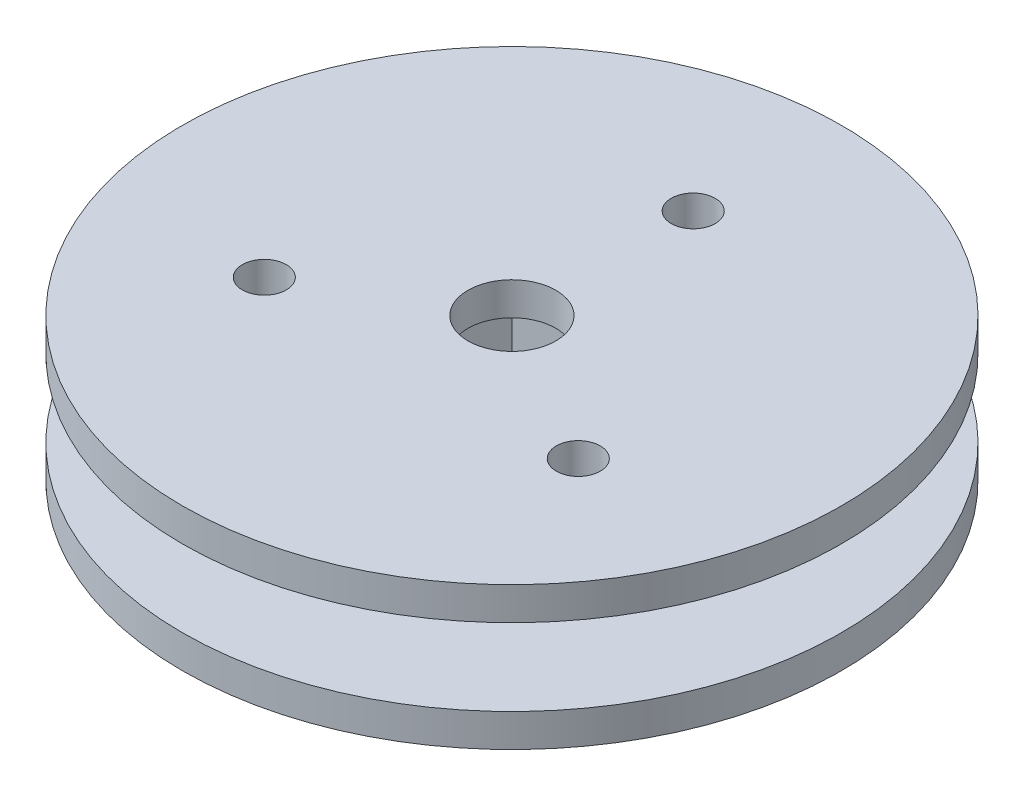
ISO-10303-21;
HEADER;
FILE_DESCRIPTION(('STEP AP214'),'2;1');
FILE_NAME('part.step','',(''),(''),'','','');
FILE_SCHEMA(('AUTOMOTIVE_DESIGN { 1 0 10303 214 1 1 1 1 }'));
ENDSEC;
DATA;
#1=APPLICATION_CONTEXT('core data for automotive mechanical design processes');
#2=APPLICATION_PROTOCOL_DEFINITION('international standard','automotive_design',2000,#1);
#3=PRODUCT_CONTEXT('',#1,'mechanical');
#4=PRODUCT('Part','Part','',(#3));
#5=PRODUCT_RELATED_PRODUCT_CATEGORY('part','',(#4));
#6=PRODUCT_DEFINITION_FORMATION('','',#4);
#7=PRODUCT_DEFINITION_CONTEXT('part definition',#1,'design');
#8=PRODUCT_DEFINITION('design','',#6,#7);
#9=PRODUCT_DEFINITION_SHAPE('','',#8);
#10=(LENGTH_UNIT() NAMED_UNIT(*) SI_UNIT(.MILLI.,.METRE.));
#11=(NAMED_UNIT(*) PLANE_ANGLE_UNIT() SI_UNIT($,.RADIAN.));
#12=(NAMED_UNIT(*) SI_UNIT($,.STERADIAN.) SOLID_ANGLE_UNIT());
#13=UNCERTAINTY_MEASURE_WITH_UNIT(LENGTH_MEASURE(1.E-05),#10,'distance_accuracy_value','');
#14=(GEOMETRIC_REPRESENTATION_CONTEXT(3) GLOBAL_UNCERTAINTY_ASSIGNED_CONTEXT((#13)) GLOBAL_UNIT_ASSIGNED_CONTEXT((#10,
#11,#12)) REPRESENTATION_CONTEXT('',''));
#15=CARTESIAN_POINT('',(0.,0.,0.));
#16=DIRECTION('',(0.,0.,1.));
#17=DIRECTION('',(1.,0.,0.));
#18=AXIS2_PLACEMENT_3D('',#15,#16,#17);
#19=CARTESIAN_POINT('',(0.,1.5,0.));
#20=DIRECTION('',(0.,1.,0.));
#21=DIRECTION('',(0.,0.,1.));
#22=AXIS2_PLACEMENT_3D('',#19,#20,#21);
#23=PLANE('',#22);
#24=CARTESIAN_POINT('',(0.,1.5,-8.25));
#25=DIRECTION('',(0.,1.,0.));
#26=DIRECTION('',(0.,0.,1.));
#27=AXIS2_PLACEMENT_3D('',#24,#25,#26);
#28=CIRCLE('',#27,1.);
#29=CARTESIAN_POINT('',(0.,1.5,-7.25));
#30=VERTEX_POINT('',#29);
#31=EDGE_CURVE('E173',#30,#30,#28,.T.);
#32=ORIENTED_EDGE('',*,*,#31,.F.);
#33=EDGE_LOOP('',(#32));
#34=FACE_BOUND('',#33,.T.);
#35=CARTESIAN_POINT('',(-7.14470958122163,1.5,4.12499999999998));
#36=DIRECTION('',(0.,1.,0.));
#37=DIRECTION('',(0.,0.,1.));
#38=AXIS2_PLACEMENT_3D('',#35,#36,#37);
#39=CIRCLE('',#38,1.);
#40=CARTESIAN_POINT('',(-7.14470958122163,1.5,5.12499999999998));
#41=VERTEX_POINT('',#40);
#42=EDGE_CURVE('E188',#41,#41,#39,.T.);
#43=ORIENTED_EDGE('',*,*,#42,.F.);
#44=EDGE_LOOP('',(#43));
#45=FACE_BOUND('',#44,.T.);
#46=CARTESIAN_POINT('',(7.14470958122163,1.5,4.12499999999998));
#47=DIRECTION('',(0.,1.,0.));
#48=DIRECTION('',(0.,0.,1.));
#49=AXIS2_PLACEMENT_3D('',#46,#47,#48);
#50=CIRCLE('',#49,1.);
#51=CARTESIAN_POINT('',(7.14470958122163,1.5,5.12499999999998));
#52=VERTEX_POINT('',#51);
#53=EDGE_CURVE('E200',#52,#52,#50,.T.);
#54=ORIENTED_EDGE('',*,*,#53,.F.);
#55=EDGE_LOOP('',(#54));
#56=FACE_BOUND('',#55,.T.);
#57=CARTESIAN_POINT('',(0.,1.5,0.));
#58=DIRECTION('',(0.,1.,0.));
#59=DIRECTION('',(0.,0.,1.));
#60=AXIS2_PLACEMENT_3D('',#57,#58,#59);
#61=CIRCLE('',#60,15.);
#62=CARTESIAN_POINT('',(0.,1.5,15.));
#63=VERTEX_POINT('',#62);
#64=EDGE_CURVE('E137',#63,#63,#61,.T.);
#65=ORIENTED_EDGE('',*,*,#64,.T.);
#66=EDGE_LOOP('',(#65));
#67=FACE_BOUND('',#66,.T.);
#68=CARTESIAN_POINT('',(0.,1.5,0.));
#69=DIRECTION('',(0.,1.,0.));
#70=DIRECTION('',(0.,0.,1.));
#71=AXIS2_PLACEMENT_3D('',#68,#69,#70);
#72=CIRCLE('',#71,6.);
#73=CARTESIAN_POINT('',(0.,1.5,6.));
#74=VERTEX_POINT('',#73);
#75=EDGE_CURVE('E128',#74,#74,#72,.T.);
#76=ORIENTED_EDGE('',*,*,#75,.F.);
#77=EDGE_LOOP('',(#76));
#78=FACE_BOUND('',#77,.T.);
#79=ADVANCED_FACE('F54',(#34,#45,#56,#67,#78),#23,.T.);
#80=CARTESIAN_POINT('',(0.,1.5,0.));
#81=DIRECTION('',(0.,-1.,0.));
#82=DIRECTION('',(0.,0.,-1.));
#83=AXIS2_PLACEMENT_3D('',#80,#81,#82);
#84=CYLINDRICAL_SURFACE('',#83,15.);
#85=ORIENTED_EDGE('',*,*,#64,.F.);
#86=EDGE_LOOP('',(#85));
#87=FACE_BOUND('',#86,.T.);
#88=CARTESIAN_POINT('',(0.,0.,0.));
#89=DIRECTION('',(0.,1.,0.));
#90=DIRECTION('',(0.,0.,1.));
#91=AXIS2_PLACEMENT_3D('',#88,#89,#90);
#92=CIRCLE('',#91,15.);
#93=CARTESIAN_POINT('',(0.,0.,15.));
#94=VERTEX_POINT('',#93);
#95=EDGE_CURVE('E133',#94,#94,#92,.T.);
#96=ORIENTED_EDGE('',*,*,#95,.T.);
#97=EDGE_LOOP('',(#96));
#98=FACE_BOUND('',#97,.T.);
#99=ADVANCED_FACE('F56',(#87,#98),#84,.T.);
#100=CARTESIAN_POINT('',(0.,0.,0.));
#101=DIRECTION('',(0.,1.,0.));
#102=DIRECTION('',(0.,0.,1.));
#103=AXIS2_PLACEMENT_3D('',#100,#101,#102);
#104=PLANE('',#103);
#105=CARTESIAN_POINT('',(0.,0.,-8.25));
#106=DIRECTION('',(0.,1.,0.));
#107=DIRECTION('',(0.,0.,1.));
#108=AXIS2_PLACEMENT_3D('',#105,#106,#107);
#109=CIRCLE('',#108,1.);
#110=CARTESIAN_POINT('',(0.,0.,-7.25));
#111=VERTEX_POINT('',#110);
#112=EDGE_CURVE('E180',#111,#111,#109,.T.);
#113=ORIENTED_EDGE('',*,*,#112,.T.);
#114=EDGE_LOOP('',(#113));
#115=FACE_BOUND('',#114,.T.);
#116=CARTESIAN_POINT('',(-7.14470958122163,0.,4.12499999999998));
#117=DIRECTION('',(0.,1.,0.));
#118=DIRECTION('',(0.,0.,1.));
#119=AXIS2_PLACEMENT_3D('',#116,#117,#118);
#120=CIRCLE('',#119,1.);
#121=CARTESIAN_POINT('',(-7.14470958122163,0.,5.12499999999998));
#122=VERTEX_POINT('',#121);
#123=EDGE_CURVE('E192',#122,#122,#120,.T.);
#124=ORIENTED_EDGE('',*,*,#123,.T.);
#125=EDGE_LOOP('',(#124));
#126=FACE_BOUND('',#125,.T.);
#127=CARTESIAN_POINT('',(7.14470958122163,0.,4.12499999999998));
#128=DIRECTION('',(0.,1.,0.));
#129=DIRECTION('',(0.,0.,1.));
#130=AXIS2_PLACEMENT_3D('',#127,#128,#129);
#131=CIRCLE('',#130,1.);
#132=CARTESIAN_POINT('',(7.14470958122163,0.,5.12499999999998));
#133=VERTEX_POINT('',#132);
#134=EDGE_CURVE('E204',#133,#133,#131,.T.);
#135=ORIENTED_EDGE('',*,*,#134,.T.);
#136=EDGE_LOOP('',(#135));
#137=FACE_BOUND('',#136,.T.);
#138=DIRECTION('',(-1.,0.,0.));
#139=VECTOR('',#138,1.);
#140=CARTESIAN_POINT('',(0.,0.,-3.75));
#141=LINE('',#140,#139);
#142=CARTESIAN_POINT('',(3.75,0.,-3.75));
#143=VERTEX_POINT('',#142);
#144=CARTESIAN_POINT('',(-3.75,0.,-3.75));
#145=VERTEX_POINT('',#144);
#146=EDGE_CURVE('E63',#143,#145,#141,.T.);
#147=ORIENTED_EDGE('',*,*,#146,.T.);
#148=DIRECTION('',(0.,0.,1.));
#149=VECTOR('',#148,1.);
#150=CARTESIAN_POINT('',(-3.75,0.,0.));
#151=LINE('',#150,#149);
#152=CARTESIAN_POINT('',(-3.75,0.,3.75));
#153=VERTEX_POINT('',#152);
#154=EDGE_CURVE('E12',#145,#153,#151,.T.);
#155=ORIENTED_EDGE('',*,*,#154,.T.);
#156=DIRECTION('',(1.,0.,0.));
#157=VECTOR('',#156,1.);
#158=CARTESIAN_POINT('',(0.,0.,3.75));
#159=LINE('',#158,#157);
#160=CARTESIAN_POINT('',(3.75,0.,3.75));
#161=VERTEX_POINT('',#160);
#162=EDGE_CURVE('E141',#153,#161,#159,.T.);
#163=ORIENTED_EDGE('',*,*,#162,.T.);
#164=DIRECTION('',(0.,0.,-1.));
#165=VECTOR('',#164,1.);
#166=CARTESIAN_POINT('',(3.75,0.,0.));
#167=LINE('',#166,#165);
#168=EDGE_CURVE('E148',#161,#143,#167,.T.);
#169=ORIENTED_EDGE('',*,*,#168,.T.);
#170=EDGE_LOOP('',(#147,#155,#163,#169));
#171=FACE_BOUND('',#170,.T.);
#172=ORIENTED_EDGE('',*,*,#95,.F.);
#173=EDGE_LOOP('',(#172));
#174=FACE_BOUND('',#173,.T.);
#175=ADVANCED_FACE('F152',(#115,#126,#137,#171,#174),#104,.F.);
#176=CARTESIAN_POINT('',(0.,5.,0.));
#177=DIRECTION('',(0.,-1.,0.));
#178=DIRECTION('',(0.,0.,-1.));
#179=AXIS2_PLACEMENT_3D('',#176,#177,#178);
#180=CYLINDRICAL_SURFACE('',#179,6.);
#181=CARTESIAN_POINT('',(0.,5.,0.));
#182=DIRECTION('',(0.,1.,0.));
#183=DIRECTION('',(0.,0.,1.));
#184=AXIS2_PLACEMENT_3D('',#181,#182,#183);
#185=CIRCLE('',#184,6.);
#186=CARTESIAN_POINT('',(0.,5.,6.));
#187=VERTEX_POINT('',#186);
#188=EDGE_CURVE('E129',#187,#187,#185,.T.);
#189=ORIENTED_EDGE('',*,*,#188,.F.);
#190=EDGE_LOOP('',(#189));
#191=FACE_BOUND('',#190,.T.);
#192=ORIENTED_EDGE('',*,*,#75,.T.);
#193=EDGE_LOOP('',(#192));
#194=FACE_BOUND('',#193,.T.);
#195=ADVANCED_FACE('F254',(#191,#194),#180,.T.);
#196=CARTESIAN_POINT('',(-3.75,5.,3.75));
#197=DIRECTION('',(0.,0.,-1.));
#198=DIRECTION('',(-1.,0.,0.));
#199=AXIS2_PLACEMENT_3D('',#196,#197,#198);
#200=PLANE('',#199);
#201=DIRECTION('',(0.,-1.,0.));
#202=VECTOR('',#201,1.);
#203=CARTESIAN_POINT('',(3.75,5.,3.75));
#204=LINE('',#203,#202);
#205=CARTESIAN_POINT('',(3.75,5.,3.75));
#206=VERTEX_POINT('',#205);
#207=EDGE_CURVE('E70',#206,#161,#204,.T.);
#208=ORIENTED_EDGE('',*,*,#207,.T.);
#209=ORIENTED_EDGE('',*,*,#162,.F.);
#210=DIRECTION('',(0.,-1.,0.));
#211=VECTOR('',#210,1.);
#212=CARTESIAN_POINT('',(-3.75,5.,3.75));
#213=LINE('',#212,#211);
#214=CARTESIAN_POINT('',(-3.75,5.,3.75));
#215=VERTEX_POINT('',#214);
#216=EDGE_CURVE('E118',#215,#153,#213,.T.);
#217=ORIENTED_EDGE('',*,*,#216,.F.);
#218=DIRECTION('',(1.,0.,0.));
#219=VECTOR('',#218,1.);
#220=CARTESIAN_POINT('',(-3.75,5.,3.75));
#221=LINE('',#220,#219);
#222=EDGE_CURVE('E104',#215,#206,#221,.T.);
#223=ORIENTED_EDGE('',*,*,#222,.T.);
#224=EDGE_LOOP('',(#208,#209,#217,#223));
#225=FACE_BOUND('',#224,.T.);
#226=ADVANCED_FACE('F156',(#225),#200,.T.);
#227=CARTESIAN_POINT('',(3.75,5.,-3.75));
#228=DIRECTION('',(1.,0.,0.));
#229=DIRECTION('',(0.,0.,-1.));
#230=AXIS2_PLACEMENT_3D('',#227,#228,#229);
#231=PLANE('',#230);
#232=DIRECTION('',(0.,-1.,0.));
#233=VECTOR('',#232,1.);
#234=CARTESIAN_POINT('',(3.75,5.,-3.75));
#235=LINE('',#234,#233);
#236=CARTESIAN_POINT('',(3.75,5.,-3.75));
#237=VERTEX_POINT('',#236);
#238=EDGE_CURVE('E99',#237,#143,#235,.T.);
#239=ORIENTED_EDGE('',*,*,#238,.T.);
#240=ORIENTED_EDGE('',*,*,#168,.F.);
#241=ORIENTED_EDGE('',*,*,#207,.F.);
#242=DIRECTION('',(0.,0.,1.));
#243=VECTOR('',#242,1.);
#244=CARTESIAN_POINT('',(3.75,5.,-3.75));
#245=LINE('',#244,#243);
#246=EDGE_CURVE('E97',#237,#206,#245,.T.);
#247=ORIENTED_EDGE('',*,*,#246,.F.);
#248=EDGE_LOOP('',(#239,#240,#241,#247));
#249=FACE_BOUND('',#248,.T.);
#250=ADVANCED_FACE('F98',(#249),#231,.F.);
#251=CARTESIAN_POINT('',(-3.75,5.,-3.75));
#252=DIRECTION('',(0.,0.,-1.));
#253=DIRECTION('',(-1.,0.,0.));
#254=AXIS2_PLACEMENT_3D('',#251,#252,#253);
#255=PLANE('',#254);
#256=DIRECTION('',(0.,-1.,0.));
#257=VECTOR('',#256,1.);
#258=CARTESIAN_POINT('',(-3.75,5.,-3.75));
#259=LINE('',#258,#257);
#260=CARTESIAN_POINT('',(-3.75,5.,-3.75));
#261=VERTEX_POINT('',#260);
#262=EDGE_CURVE('E110',#261,#145,#259,.T.);
#263=ORIENTED_EDGE('',*,*,#262,.T.);
#264=ORIENTED_EDGE('',*,*,#146,.F.);
#265=ORIENTED_EDGE('',*,*,#238,.F.);
#266=DIRECTION('',(1.,0.,0.));
#267=VECTOR('',#266,1.);
#268=CARTESIAN_POINT('',(-3.75,5.,-3.75));
#269=LINE('',#268,#267);
#270=EDGE_CURVE('E78',#261,#237,#269,.T.);
#271=ORIENTED_EDGE('',*,*,#270,.F.);
#272=EDGE_LOOP('',(#263,#264,#265,#271));
#273=FACE_BOUND('',#272,.T.);
#274=ADVANCED_FACE('F106',(#273),#255,.F.);
#275=CARTESIAN_POINT('',(-3.75,5.,-3.75));
#276=DIRECTION('',(1.,0.,0.));
#277=DIRECTION('',(0.,0.,-1.));
#278=AXIS2_PLACEMENT_3D('',#275,#276,#277);
#279=PLANE('',#278);
#280=ORIENTED_EDGE('',*,*,#216,.T.);
#281=ORIENTED_EDGE('',*,*,#154,.F.);
#282=ORIENTED_EDGE('',*,*,#262,.F.);
#283=DIRECTION('',(0.,0.,1.));
#284=VECTOR('',#283,1.);
#285=CARTESIAN_POINT('',(-3.75,5.,-3.75));
#286=LINE('',#285,#284);
#287=EDGE_CURVE('E114',#261,#215,#286,.T.);
#288=ORIENTED_EDGE('',*,*,#287,.T.);
#289=EDGE_LOOP('',(#280,#281,#282,#288));
#290=FACE_BOUND('',#289,.T.);
#291=ADVANCED_FACE('F312',(#290),#279,.T.);
#292=CARTESIAN_POINT('',(0.,5.,0.));
#293=DIRECTION('',(0.,1.,0.));
#294=DIRECTION('',(0.,0.,1.));
#295=AXIS2_PLACEMENT_3D('',#292,#293,#294);
#296=PLANE('',#295);
#297=CARTESIAN_POINT('',(0.,5.,0.));
#298=DIRECTION('',(0.,1.,0.));
#299=DIRECTION('',(0.,0.,1.));
#300=AXIS2_PLACEMENT_3D('',#297,#298,#299);
#301=CIRCLE('',#300,2.);
#302=CARTESIAN_POINT('',(0.,5.,2.));
#303=VERTEX_POINT('',#302);
#304=EDGE_CURVE('E167',#303,#303,#301,.T.);
#305=ORIENTED_EDGE('',*,*,#304,.T.);
#306=EDGE_LOOP('',(#305));
#307=FACE_BOUND('',#306,.T.);
#308=ORIENTED_EDGE('',*,*,#270,.T.);
#309=ORIENTED_EDGE('',*,*,#246,.T.);
#310=ORIENTED_EDGE('',*,*,#222,.F.);
#311=ORIENTED_EDGE('',*,*,#287,.F.);
#312=EDGE_LOOP('',(#308,#309,#310,#311));
#313=FACE_BOUND('',#312,.T.);
#314=ADVANCED_FACE('F113',(#307,#313),#296,.F.);
#315=CARTESIAN_POINT('',(0.,5.,-8.25));
#316=DIRECTION('',(0.,1.,0.));
#317=DIRECTION('',(0.,0.,1.));
#318=AXIS2_PLACEMENT_3D('',#315,#316,#317);
#319=CIRCLE('',#318,1.);
#320=CARTESIAN_POINT('',(0.,5.,-7.25));
#321=VERTEX_POINT('',#320);
#322=EDGE_CURVE('E184',#321,#321,#319,.T.);
#323=ORIENTED_EDGE('',*,*,#322,.T.);
#324=EDGE_LOOP('',(#323));
#325=FACE_BOUND('',#324,.T.);
#326=CARTESIAN_POINT('',(-7.14470958122163,5.,4.12499999999998));
#327=DIRECTION('',(0.,1.,0.));
#328=DIRECTION('',(0.,0.,1.));
#329=AXIS2_PLACEMENT_3D('',#326,#327,#328);
#330=CIRCLE('',#329,1.);
#331=CARTESIAN_POINT('',(-7.14470958122163,5.,5.12499999999998));
#332=VERTEX_POINT('',#331);
#333=EDGE_CURVE('E196',#332,#332,#330,.T.);
#334=ORIENTED_EDGE('',*,*,#333,.T.);
#335=EDGE_LOOP('',(#334));
#336=FACE_BOUND('',#335,.T.);
#337=CARTESIAN_POINT('',(7.14470958122163,5.,4.12499999999998));
#338=DIRECTION('',(0.,1.,0.));
#339=DIRECTION('',(0.,0.,1.));
#340=AXIS2_PLACEMENT_3D('',#337,#338,#339);
#341=CIRCLE('',#340,1.);
#342=CARTESIAN_POINT('',(7.14470958122163,5.,5.12499999999998));
#343=VERTEX_POINT('',#342);
#344=EDGE_CURVE('E208',#343,#343,#341,.T.);
#345=ORIENTED_EDGE('',*,*,#344,.T.);
#346=EDGE_LOOP('',(#345));
#347=FACE_BOUND('',#346,.T.);
#348=CARTESIAN_POINT('',(0.,5.,0.));
#349=DIRECTION('',(0.,1.,0.));
#350=DIRECTION('',(0.,0.,1.));
#351=AXIS2_PLACEMENT_3D('',#348,#349,#350);
#352=CIRCLE('',#351,15.);
#353=CARTESIAN_POINT('',(0.,5.,15.));
#354=VERTEX_POINT('',#353);
#355=EDGE_CURVE('E162',#354,#354,#352,.T.);
#356=ORIENTED_EDGE('',*,*,#355,.F.);
#357=EDGE_LOOP('',(#356));
#358=FACE_BOUND('',#357,.T.);
#359=ORIENTED_EDGE('',*,*,#188,.T.);
#360=EDGE_LOOP('',(#359));
#361=FACE_BOUND('',#360,.T.);
#362=ADVANCED_FACE('F244',(#325,#336,#347,#358,#361),#296,.F.);
#363=CARTESIAN_POINT('',(0.,6.5,0.));
#364=DIRECTION('',(0.,-1.,0.));
#365=DIRECTION('',(0.,0.,-1.));
#366=AXIS2_PLACEMENT_3D('',#363,#364,#365);
#367=CYLINDRICAL_SURFACE('',#366,15.);
#368=CARTESIAN_POINT('',(0.,6.5,0.));
#369=DIRECTION('',(0.,1.,0.));
#370=DIRECTION('',(0.,0.,1.));
#371=AXIS2_PLACEMENT_3D('',#368,#369,#370);
#372=CIRCLE('',#371,15.);
#373=CARTESIAN_POINT('',(0.,6.5,15.));
#374=VERTEX_POINT('',#373);
#375=EDGE_CURVE('E159',#374,#374,#372,.T.);
#376=ORIENTED_EDGE('',*,*,#375,.F.);
#377=EDGE_LOOP('',(#376));
#378=FACE_BOUND('',#377,.T.);
#379=ORIENTED_EDGE('',*,*,#355,.T.);
#380=EDGE_LOOP('',(#379));
#381=FACE_BOUND('',#380,.T.);
#382=ADVANCED_FACE('F232',(#378,#381),#367,.T.);
#383=CARTESIAN_POINT('',(0.,6.5,0.));
#384=DIRECTION('',(0.,1.,0.));
#385=DIRECTION('',(0.,0.,1.));
#386=AXIS2_PLACEMENT_3D('',#383,#384,#385);
#387=PLANE('',#386);
#388=CARTESIAN_POINT('',(0.,6.5,-8.25));
#389=DIRECTION('',(0.,1.,0.));
#390=DIRECTION('',(0.,0.,1.));
#391=AXIS2_PLACEMENT_3D('',#388,#389,#390);
#392=CIRCLE('',#391,1.);
#393=CARTESIAN_POINT('',(0.,6.5,-7.25));
#394=VERTEX_POINT('',#393);
#395=EDGE_CURVE('E212',#394,#394,#392,.T.);
#396=ORIENTED_EDGE('',*,*,#395,.F.);
#397=EDGE_LOOP('',(#396));
#398=FACE_BOUND('',#397,.T.);
#399=CARTESIAN_POINT('',(-7.14470958122163,6.5,4.12499999999998));
#400=DIRECTION('',(0.,1.,0.));
#401=DIRECTION('',(0.,0.,1.));
#402=AXIS2_PLACEMENT_3D('',#399,#400,#401);
#403=CIRCLE('',#402,1.);
#404=CARTESIAN_POINT('',(-7.14470958122163,6.5,5.12499999999998));
#405=VERTEX_POINT('',#404);
#406=EDGE_CURVE('E217',#405,#405,#403,.T.);
#407=ORIENTED_EDGE('',*,*,#406,.F.);
#408=EDGE_LOOP('',(#407));
#409=FACE_BOUND('',#408,.T.);
#410=CARTESIAN_POINT('',(7.14470958122163,6.5,4.12499999999998));
#411=DIRECTION('',(0.,1.,0.));
#412=DIRECTION('',(0.,0.,1.));
#413=AXIS2_PLACEMENT_3D('',#410,#411,#412);
#414=CIRCLE('',#413,1.);
#415=CARTESIAN_POINT('',(7.14470958122163,6.5,5.12499999999998));
#416=VERTEX_POINT('',#415);
#417=EDGE_CURVE('E213',#416,#416,#414,.T.);
#418=ORIENTED_EDGE('',*,*,#417,.F.);
#419=EDGE_LOOP('',(#418));
#420=FACE_BOUND('',#419,.T.);
#421=CARTESIAN_POINT('',(0.,6.5,0.));
#422=DIRECTION('',(0.,1.,0.));
#423=DIRECTION('',(0.,0.,1.));
#424=AXIS2_PLACEMENT_3D('',#421,#422,#423);
#425=CIRCLE('',#424,2.);
#426=CARTESIAN_POINT('',(0.,6.5,2.));
#427=VERTEX_POINT('',#426);
#428=EDGE_CURVE('E169',#427,#427,#425,.T.);
#429=ORIENTED_EDGE('',*,*,#428,.F.);
#430=EDGE_LOOP('',(#429));
#431=FACE_BOUND('',#430,.T.);
#432=ORIENTED_EDGE('',*,*,#375,.T.);
#433=EDGE_LOOP('',(#432));
#434=FACE_BOUND('',#433,.T.);
#435=ADVANCED_FACE('F228',(#398,#409,#420,#431,#434),#387,.T.);
#436=CARTESIAN_POINT('',(0.,5.,0.));
#437=DIRECTION('',(0.,1.,0.));
#438=DIRECTION('',(0.,0.,1.));
#439=AXIS2_PLACEMENT_3D('',#436,#437,#438);
#440=CYLINDRICAL_SURFACE('',#439,2.);
#441=ORIENTED_EDGE('',*,*,#304,.F.);
#442=EDGE_LOOP('',(#441));
#443=FACE_BOUND('',#442,.T.);
#444=ORIENTED_EDGE('',*,*,#428,.T.);
#445=EDGE_LOOP('',(#444));
#446=FACE_BOUND('',#445,.T.);
#447=ADVANCED_FACE('F231',(#443,#446),#440,.F.);
#448=CARTESIAN_POINT('',(7.14470958122163,-3.5,4.12499999999998));
#449=DIRECTION('',(0.,1.,0.));
#450=DIRECTION('',(0.,0.,1.));
#451=AXIS2_PLACEMENT_3D('',#448,#449,#450);
#452=CYLINDRICAL_SURFACE('',#451,1.);
#453=ORIENTED_EDGE('',*,*,#417,.T.);
#454=EDGE_LOOP('',(#453));
#455=FACE_BOUND('',#454,.T.);
#456=ORIENTED_EDGE('',*,*,#344,.F.);
#457=EDGE_LOOP('',(#456));
#458=FACE_BOUND('',#457,.T.);
#459=ADVANCED_FACE('F285',(#455,#458),#452,.F.);
#460=CARTESIAN_POINT('',(-7.14470958122163,-3.5,4.12499999999998));
#461=DIRECTION('',(0.,1.,0.));
#462=DIRECTION('',(0.,0.,1.));
#463=AXIS2_PLACEMENT_3D('',#460,#461,#462);
#464=CYLINDRICAL_SURFACE('',#463,1.);
#465=ORIENTED_EDGE('',*,*,#406,.T.);
#466=EDGE_LOOP('',(#465));
#467=FACE_BOUND('',#466,.T.);
#468=ORIENTED_EDGE('',*,*,#333,.F.);
#469=EDGE_LOOP('',(#468));
#470=FACE_BOUND('',#469,.T.);
#471=ADVANCED_FACE('F293',(#467,#470),#464,.F.);
#472=CARTESIAN_POINT('',(0.,-3.5,-8.25));
#473=DIRECTION('',(0.,1.,0.));
#474=DIRECTION('',(0.,0.,1.));
#475=AXIS2_PLACEMENT_3D('',#472,#473,#474);
#476=CYLINDRICAL_SURFACE('',#475,1.);
#477=ORIENTED_EDGE('',*,*,#395,.T.);
#478=EDGE_LOOP('',(#477));
#479=FACE_BOUND('',#478,.T.);
#480=ORIENTED_EDGE('',*,*,#322,.F.);
#481=EDGE_LOOP('',(#480));
#482=FACE_BOUND('',#481,.T.);
#483=ADVANCED_FACE('F225',(#479,#482),#476,.F.);
#484=ORIENTED_EDGE('',*,*,#53,.T.);
#485=EDGE_LOOP('',(#484));
#486=FACE_BOUND('',#485,.T.);
#487=ORIENTED_EDGE('',*,*,#134,.F.);
#488=EDGE_LOOP('',(#487));
#489=FACE_BOUND('',#488,.T.);
#490=ADVANCED_FACE('F280',(#486,#489),#452,.F.);
#491=ORIENTED_EDGE('',*,*,#42,.T.);
#492=EDGE_LOOP('',(#491));
#493=FACE_BOUND('',#492,.T.);
#494=ORIENTED_EDGE('',*,*,#123,.F.);
#495=EDGE_LOOP('',(#494));
#496=FACE_BOUND('',#495,.T.);
#497=ADVANCED_FACE('F282',(#493,#496),#464,.F.);
#498=ORIENTED_EDGE('',*,*,#31,.T.);
#499=EDGE_LOOP('',(#498));
#500=FACE_BOUND('',#499,.T.);
#501=ORIENTED_EDGE('',*,*,#112,.F.);
#502=EDGE_LOOP('',(#501));
#503=FACE_BOUND('',#502,.T.);
#504=ADVANCED_FACE('F290',(#500,#503),#476,.F.);
#505=CLOSED_SHELL('',(#79,#99,#175,#195,#226,#250,#274,#291,#314,#362,#382,#435,#447,#459,#471,
#483,#490,#497,#504));
#506=MANIFOLD_SOLID_BREP('B2',#505);
#507=ADVANCED_BREP_SHAPE_REPRESENTATION('',(#18,#506),#14);
#508=SHAPE_DEFINITION_REPRESENTATION(#9,#507);
ENDSEC;
END-ISO-10303-21;
